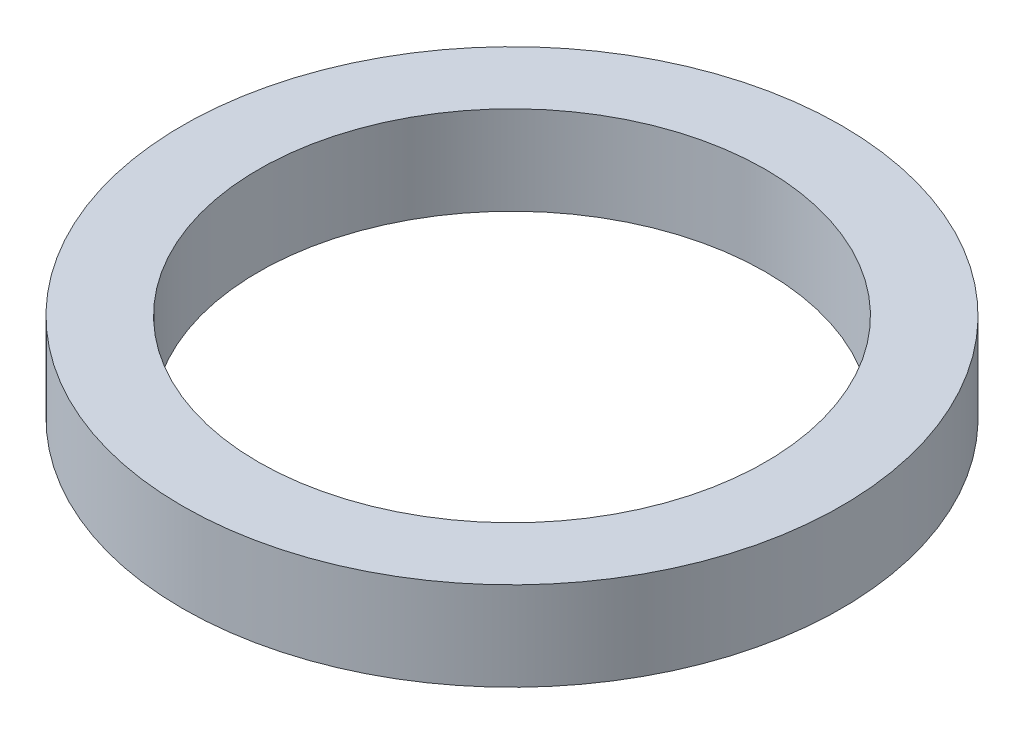
ISO-10303-21;
HEADER;
FILE_DESCRIPTION(('STEP AP214'),'2;1');
FILE_NAME('part.step','',(''),(''),'','','');
FILE_SCHEMA(('AUTOMOTIVE_DESIGN { 1 0 10303 214 1 1 1 1 }'));
ENDSEC;
DATA;
#1=APPLICATION_CONTEXT('core data for automotive mechanical design processes');
#2=APPLICATION_PROTOCOL_DEFINITION('international standard','automotive_design',2000,#1);
#3=PRODUCT_CONTEXT('',#1,'mechanical');
#4=PRODUCT('Part','Part','',(#3));
#5=PRODUCT_RELATED_PRODUCT_CATEGORY('part','',(#4));
#6=PRODUCT_DEFINITION_FORMATION('','',#4);
#7=PRODUCT_DEFINITION_CONTEXT('part definition',#1,'design');
#8=PRODUCT_DEFINITION('design','',#6,#7);
#9=PRODUCT_DEFINITION_SHAPE('','',#8);
#10=(LENGTH_UNIT() NAMED_UNIT(*) SI_UNIT(.MILLI.,.METRE.));
#11=(NAMED_UNIT(*) PLANE_ANGLE_UNIT() SI_UNIT($,.RADIAN.));
#12=(NAMED_UNIT(*) SI_UNIT($,.STERADIAN.) SOLID_ANGLE_UNIT());
#13=UNCERTAINTY_MEASURE_WITH_UNIT(LENGTH_MEASURE(1.E-05),#10,'distance_accuracy_value','');
#14=(GEOMETRIC_REPRESENTATION_CONTEXT(3) GLOBAL_UNCERTAINTY_ASSIGNED_CONTEXT((#13)) GLOBAL_UNIT_ASSIGNED_CONTEXT((#10,
#11,#12)) REPRESENTATION_CONTEXT('',''));
#15=CARTESIAN_POINT('',(0.,0.,0.));
#16=DIRECTION('',(0.,0.,1.));
#17=DIRECTION('',(1.,0.,0.));
#18=AXIS2_PLACEMENT_3D('',#15,#16,#17);
#19=CARTESIAN_POINT('',(0.,7.,0.));
#20=DIRECTION('',(0.,1.,0.));
#21=DIRECTION('',(0.,0.,1.));
#22=AXIS2_PLACEMENT_3D('',#19,#20,#21);
#23=PLANE('',#22);
#24=CARTESIAN_POINT('',(0.,7.,0.));
#25=DIRECTION('',(0.,1.,0.));
#26=DIRECTION('',(0.,0.,1.));
#27=AXIS2_PLACEMENT_3D('',#24,#25,#26);
#28=CIRCLE('',#27,26.);
#29=CARTESIAN_POINT('',(0.,7.,26.));
#30=VERTEX_POINT('',#29);
#31=EDGE_CURVE('E10',#30,#30,#28,.T.);
#32=ORIENTED_EDGE('',*,*,#31,.T.);
#33=EDGE_LOOP('',(#32));
#34=FACE_BOUND('',#33,.T.);
#35=CARTESIAN_POINT('',(0.,7.,0.));
#36=DIRECTION('',(0.,1.,0.));
#37=DIRECTION('',(0.,0.,1.));
#38=AXIS2_PLACEMENT_3D('',#35,#36,#37);
#39=CIRCLE('',#38,20.);
#40=CARTESIAN_POINT('',(0.,7.,20.));
#41=VERTEX_POINT('',#40);
#42=EDGE_CURVE('E58',#41,#41,#39,.T.);
#43=ORIENTED_EDGE('',*,*,#42,.F.);
#44=EDGE_LOOP('',(#43));
#45=FACE_BOUND('',#44,.T.);
#46=ADVANCED_FACE('F43',(#34,#45),#23,.T.);
#47=CARTESIAN_POINT('',(0.,0.,0.));
#48=DIRECTION('',(0.,1.,0.));
#49=DIRECTION('',(0.,0.,1.));
#50=AXIS2_PLACEMENT_3D('',#47,#48,#49);
#51=PLANE('',#50);
#52=CARTESIAN_POINT('',(0.,0.,0.));
#53=DIRECTION('',(0.,1.,0.));
#54=DIRECTION('',(0.,0.,1.));
#55=AXIS2_PLACEMENT_3D('',#52,#53,#54);
#56=CIRCLE('',#55,26.);
#57=CARTESIAN_POINT('',(0.,0.,26.));
#58=VERTEX_POINT('',#57);
#59=EDGE_CURVE('E47',#58,#58,#56,.T.);
#60=ORIENTED_EDGE('',*,*,#59,.F.);
#61=EDGE_LOOP('',(#60));
#62=FACE_BOUND('',#61,.T.);
#63=CARTESIAN_POINT('',(0.,0.,0.));
#64=DIRECTION('',(0.,1.,0.));
#65=DIRECTION('',(0.,0.,1.));
#66=AXIS2_PLACEMENT_3D('',#63,#64,#65);
#67=CIRCLE('',#66,20.);
#68=CARTESIAN_POINT('',(0.,0.,20.));
#69=VERTEX_POINT('',#68);
#70=EDGE_CURVE('E60',#69,#69,#67,.T.);
#71=ORIENTED_EDGE('',*,*,#70,.T.);
#72=EDGE_LOOP('',(#71));
#73=FACE_BOUND('',#72,.T.);
#74=ADVANCED_FACE('F70',(#62,#73),#51,.F.);
#75=CARTESIAN_POINT('',(0.,7.,0.));
#76=DIRECTION('',(0.,-1.,0.));
#77=DIRECTION('',(0.,0.,-1.));
#78=AXIS2_PLACEMENT_3D('',#75,#76,#77);
#79=CYLINDRICAL_SURFACE('',#78,26.);
#80=ORIENTED_EDGE('',*,*,#31,.F.);
#81=EDGE_LOOP('',(#80));
#82=FACE_BOUND('',#81,.T.);
#83=ORIENTED_EDGE('',*,*,#59,.T.);
#84=EDGE_LOOP('',(#83));
#85=FACE_BOUND('',#84,.T.);
#86=ADVANCED_FACE('F45',(#82,#85),#79,.T.);
#87=CARTESIAN_POINT('',(0.,7.,0.));
#88=DIRECTION('',(0.,-1.,0.));
#89=DIRECTION('',(0.,0.,-1.));
#90=AXIS2_PLACEMENT_3D('',#87,#88,#89);
#91=CYLINDRICAL_SURFACE('',#90,20.);
#92=ORIENTED_EDGE('',*,*,#42,.T.);
#93=EDGE_LOOP('',(#92));
#94=FACE_BOUND('',#93,.T.);
#95=ORIENTED_EDGE('',*,*,#70,.F.);
#96=EDGE_LOOP('',(#95));
#97=FACE_BOUND('',#96,.T.);
#98=ADVANCED_FACE('F66',(#94,#97),#91,.F.);
#99=CLOSED_SHELL('',(#46,#74,#86,#98));
#100=MANIFOLD_SOLID_BREP('B2',#99);
#101=ADVANCED_BREP_SHAPE_REPRESENTATION('',(#18,#100),#14);
#102=SHAPE_DEFINITION_REPRESENTATION(#9,#101);
ENDSEC;
END-ISO-10303-21;
